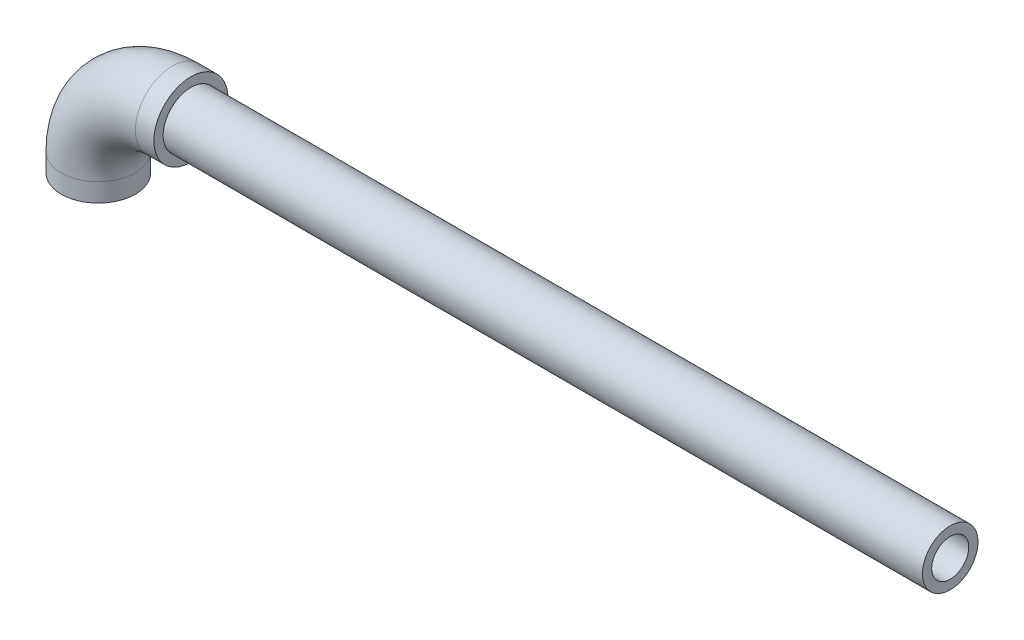
ISO-10303-21;
HEADER;
FILE_DESCRIPTION(('STEP AP214'),'2;1');
FILE_NAME('part.step','',(''),(''),'','','');
FILE_SCHEMA(('AUTOMOTIVE_DESIGN { 1 0 10303 214 1 1 1 1 }'));
ENDSEC;
DATA;
#1=APPLICATION_CONTEXT('core data for automotive mechanical design processes');
#2=APPLICATION_PROTOCOL_DEFINITION('international standard','automotive_design',2000,#1);
#3=PRODUCT_CONTEXT('',#1,'mechanical');
#4=PRODUCT('Part','Part','',(#3));
#5=PRODUCT_RELATED_PRODUCT_CATEGORY('part','',(#4));
#6=PRODUCT_DEFINITION_FORMATION('','',#4);
#7=PRODUCT_DEFINITION_CONTEXT('part definition',#1,'design');
#8=PRODUCT_DEFINITION('design','',#6,#7);
#9=PRODUCT_DEFINITION_SHAPE('','',#8);
#10=(LENGTH_UNIT() NAMED_UNIT(*) SI_UNIT(.MILLI.,.METRE.));
#11=(NAMED_UNIT(*) PLANE_ANGLE_UNIT() SI_UNIT($,.RADIAN.));
#12=(NAMED_UNIT(*) SI_UNIT($,.STERADIAN.) SOLID_ANGLE_UNIT());
#13=UNCERTAINTY_MEASURE_WITH_UNIT(LENGTH_MEASURE(1.E-05),#10,'distance_accuracy_value','');
#14=(GEOMETRIC_REPRESENTATION_CONTEXT(3) GLOBAL_UNCERTAINTY_ASSIGNED_CONTEXT((#13)) GLOBAL_UNIT_ASSIGNED_CONTEXT((#10,
#11,#12)) REPRESENTATION_CONTEXT('',''));
#15=CARTESIAN_POINT('',(0.,0.,0.));
#16=DIRECTION('',(0.,0.,1.));
#17=DIRECTION('',(1.,0.,0.));
#18=AXIS2_PLACEMENT_3D('',#15,#16,#17);
#19=CARTESIAN_POINT('',(460.,50.,0.));
#20=DIRECTION('',(1.,0.,0.));
#21=DIRECTION('',(0.,0.,-1.));
#22=AXIS2_PLACEMENT_3D('',#19,#20,#21);
#23=PLANE('',#22);
#24=CARTESIAN_POINT('',(460.,50.,0.));
#25=DIRECTION('',(1.,0.,0.));
#26=DIRECTION('',(0.,0.,-1.));
#27=AXIS2_PLACEMENT_3D('',#24,#25,#26);
#28=CIRCLE('',#27,15.);
#29=CARTESIAN_POINT('',(460.,50.,-15.));
#30=VERTEX_POINT('',#29);
#31=EDGE_CURVE('E11',#30,#30,#28,.T.);
#32=ORIENTED_EDGE('',*,*,#31,.T.);
#33=EDGE_LOOP('',(#32));
#34=FACE_BOUND('',#33,.T.);
#35=CARTESIAN_POINT('',(460.,50.,0.));
#36=DIRECTION('',(1.,0.,0.));
#37=DIRECTION('',(0.,0.,-1.));
#38=AXIS2_PLACEMENT_3D('',#35,#36,#37);
#39=CIRCLE('',#38,10.);
#40=CARTESIAN_POINT('',(460.,50.,-10.));
#41=VERTEX_POINT('',#40);
#42=EDGE_CURVE('E56',#41,#41,#39,.T.);
#43=ORIENTED_EDGE('',*,*,#42,.F.);
#44=EDGE_LOOP('',(#43));
#45=FACE_BOUND('',#44,.T.);
#46=ADVANCED_FACE('F45',(#34,#45),#23,.T.);
#47=CARTESIAN_POINT('',(50.,50.,0.));
#48=DIRECTION('',(1.,0.,0.));
#49=DIRECTION('',(0.,0.,-1.));
#50=AXIS2_PLACEMENT_3D('',#47,#48,#49);
#51=PLANE('',#50);
#52=CARTESIAN_POINT('',(50.,50.,0.));
#53=DIRECTION('',(1.,0.,0.));
#54=DIRECTION('',(0.,0.,-1.));
#55=AXIS2_PLACEMENT_3D('',#52,#53,#54);
#56=CIRCLE('',#55,15.);
#57=CARTESIAN_POINT('',(50.,50.,-15.));
#58=VERTEX_POINT('',#57);
#59=EDGE_CURVE('E49',#58,#58,#56,.T.);
#60=ORIENTED_EDGE('',*,*,#59,.F.);
#61=EDGE_LOOP('',(#60));
#62=FACE_BOUND('',#61,.T.);
#63=CARTESIAN_POINT('',(50.,50.,0.));
#64=DIRECTION('',(1.,0.,0.));
#65=DIRECTION('',(0.,0.,-1.));
#66=AXIS2_PLACEMENT_3D('',#63,#64,#65);
#67=CIRCLE('',#66,10.);
#68=CARTESIAN_POINT('',(50.,50.,-10.));
#69=VERTEX_POINT('',#68);
#70=EDGE_CURVE('E58',#69,#69,#67,.T.);
#71=ORIENTED_EDGE('',*,*,#70,.T.);
#72=EDGE_LOOP('',(#71));
#73=FACE_BOUND('',#72,.T.);
#74=ADVANCED_FACE('F68',(#62,#73),#51,.F.);
#75=CARTESIAN_POINT('',(460.,50.,0.));
#76=DIRECTION('',(-1.,0.,0.));
#77=DIRECTION('',(0.,0.,1.));
#78=AXIS2_PLACEMENT_3D('',#75,#76,#77);
#79=CYLINDRICAL_SURFACE('',#78,15.);
#80=ORIENTED_EDGE('',*,*,#31,.F.);
#81=EDGE_LOOP('',(#80));
#82=FACE_BOUND('',#81,.T.);
#83=ORIENTED_EDGE('',*,*,#59,.T.);
#84=EDGE_LOOP('',(#83));
#85=FACE_BOUND('',#84,.T.);
#86=ADVANCED_FACE('F47',(#82,#85),#79,.T.);
#87=CARTESIAN_POINT('',(460.,50.,0.));
#88=DIRECTION('',(-1.,0.,0.));
#89=DIRECTION('',(0.,0.,1.));
#90=AXIS2_PLACEMENT_3D('',#87,#88,#89);
#91=CYLINDRICAL_SURFACE('',#90,10.);
#92=ORIENTED_EDGE('',*,*,#42,.T.);
#93=EDGE_LOOP('',(#92));
#94=FACE_BOUND('',#93,.T.);
#95=ORIENTED_EDGE('',*,*,#70,.F.);
#96=EDGE_LOOP('',(#95));
#97=FACE_BOUND('',#96,.T.);
#98=ADVANCED_FACE('F64',(#94,#97),#91,.F.);
#99=CLOSED_SHELL('',(#46,#74,#86,#98));
#100=MANIFOLD_SOLID_BREP('B2',#99);
#101=CARTESIAN_POINT('',(0.,0.,0.));
#102=DIRECTION('',(0.,1.,0.));
#103=DIRECTION('',(0.,0.,1.));
#104=AXIS2_PLACEMENT_3D('',#101,#102,#103);
#105=CYLINDRICAL_SURFACE('',#104,20.);
#106=CARTESIAN_POINT('',(0.,10.,0.));
#107=DIRECTION('',(0.,1.,0.));
#108=DIRECTION('',(0.,0.,1.));
#109=AXIS2_PLACEMENT_3D('',#106,#107,#108);
#110=CIRCLE('',#109,20.);
#111=CARTESIAN_POINT('',(-20.,10.,0.));
#112=VERTEX_POINT('',#111);
#113=EDGE_CURVE('E130',#112,#112,#110,.T.);
#114=ORIENTED_EDGE('',*,*,#113,.F.);
#115=EDGE_LOOP('',(#114));
#116=FACE_BOUND('',#115,.T.);
#117=CARTESIAN_POINT('',(0.,0.,0.));
#118=DIRECTION('',(0.,1.,0.));
#119=DIRECTION('',(0.,0.,1.));
#120=AXIS2_PLACEMENT_3D('',#117,#118,#119);
#121=CIRCLE('',#120,20.);
#122=CARTESIAN_POINT('',(0.,0.,20.));
#123=VERTEX_POINT('',#122);
#124=EDGE_CURVE('E128',#123,#123,#121,.T.);
#125=ORIENTED_EDGE('',*,*,#124,.T.);
#126=EDGE_LOOP('',(#125));
#127=FACE_BOUND('',#126,.T.);
#128=ADVANCED_FACE('F107',(#116,#127),#105,.T.);
#129=CARTESIAN_POINT('',(40.,10.,0.));
#130=DIRECTION('',(0.,0.,-1.));
#131=DIRECTION('',(-1.,0.,0.));
#132=AXIS2_PLACEMENT_3D('',#129,#130,#131);
#133=TOROIDAL_SURFACE('',#132,40.,20.);
#134=CARTESIAN_POINT('',(40.,50.,0.));
#135=DIRECTION('',(1.,0.,0.));
#136=DIRECTION('',(0.,0.,1.));
#137=AXIS2_PLACEMENT_3D('',#134,#135,#136);
#138=CIRCLE('',#137,20.);
#139=CARTESIAN_POINT('',(40.,70.,0.));
#140=VERTEX_POINT('',#139);
#141=EDGE_CURVE('E111',#140,#140,#138,.T.);
#142=CARTESIAN_POINT('',(40.,10.,0.));
#143=DIRECTION('',(0.,0.,-1.));
#144=DIRECTION('',(-1.,0.,0.));
#145=AXIS2_PLACEMENT_3D('',#142,#143,#144);
#146=CIRCLE('',#145,60.);
#147=EDGE_CURVE('',#112,#140,#146,.T.);
#148=ORIENTED_EDGE('',*,*,#113,.T.);
#149=ORIENTED_EDGE('',*,*,#141,.F.);
#150=ORIENTED_EDGE('',*,*,#147,.T.);
#151=ORIENTED_EDGE('',*,*,#147,.F.);
#152=EDGE_LOOP('',(#148,#150,#149,#151));
#153=FACE_BOUND('',#152,.T.);
#154=ADVANCED_FACE('F138',(#153),#133,.T.);
#155=CARTESIAN_POINT('',(40.,50.,0.));
#156=DIRECTION('',(1.,0.,0.));
#157=DIRECTION('',(0.,0.,-1.));
#158=AXIS2_PLACEMENT_3D('',#155,#156,#157);
#159=CYLINDRICAL_SURFACE('',#158,20.);
#160=CARTESIAN_POINT('',(50.,50.,0.));
#161=DIRECTION('',(1.,0.,0.));
#162=DIRECTION('',(0.,0.,1.));
#163=AXIS2_PLACEMENT_3D('',#160,#161,#162);
#164=CIRCLE('',#163,20.);
#165=CARTESIAN_POINT('',(50.,50.,20.));
#166=VERTEX_POINT('',#165);
#167=EDGE_CURVE('E124',#166,#166,#164,.T.);
#168=ORIENTED_EDGE('',*,*,#167,.F.);
#169=EDGE_LOOP('',(#168));
#170=FACE_BOUND('',#169,.T.);
#171=ORIENTED_EDGE('',*,*,#141,.T.);
#172=EDGE_LOOP('',(#171));
#173=FACE_BOUND('',#172,.T.);
#174=ADVANCED_FACE('F109',(#170,#173),#159,.T.);
#175=CARTESIAN_POINT('',(0.,0.,0.));
#176=DIRECTION('',(0.,1.,0.));
#177=DIRECTION('',(0.,0.,1.));
#178=AXIS2_PLACEMENT_3D('',#175,#176,#177);
#179=PLANE('',#178);
#180=CARTESIAN_POINT('',(0.,0.,0.));
#181=DIRECTION('',(0.,1.,0.));
#182=DIRECTION('',(0.,0.,1.));
#183=AXIS2_PLACEMENT_3D('',#180,#181,#182);
#184=CIRCLE('',#183,15.);
#185=CARTESIAN_POINT('',(0.,0.,15.));
#186=VERTEX_POINT('',#185);
#187=EDGE_CURVE('E127',#186,#186,#184,.F.);
#188=ORIENTED_EDGE('',*,*,#187,.F.);
#189=EDGE_LOOP('',(#188));
#190=FACE_BOUND('',#189,.T.);
#191=ORIENTED_EDGE('',*,*,#124,.F.);
#192=EDGE_LOOP('',(#191));
#193=FACE_BOUND('',#192,.T.);
#194=ADVANCED_FACE('F144',(#190,#193),#179,.F.);
#195=CARTESIAN_POINT('',(50.,50.,0.));
#196=DIRECTION('',(1.,0.,0.));
#197=DIRECTION('',(0.,0.,1.));
#198=AXIS2_PLACEMENT_3D('',#195,#196,#197);
#199=PLANE('',#198);
#200=CARTESIAN_POINT('',(50.,50.,0.));
#201=DIRECTION('',(1.,0.,0.));
#202=DIRECTION('',(0.,0.,1.));
#203=AXIS2_PLACEMENT_3D('',#200,#201,#202);
#204=CIRCLE('',#203,15.);
#205=CARTESIAN_POINT('',(50.,50.,15.));
#206=VERTEX_POINT('',#205);
#207=EDGE_CURVE('E44',#206,#206,#204,.F.);
#208=ORIENTED_EDGE('',*,*,#207,.T.);
#209=EDGE_LOOP('',(#208));
#210=FACE_BOUND('',#209,.T.);
#211=ORIENTED_EDGE('',*,*,#167,.T.);
#212=EDGE_LOOP('',(#211));
#213=FACE_BOUND('',#212,.T.);
#214=ADVANCED_FACE('F162',(#210,#213),#199,.T.);
#215=CARTESIAN_POINT('',(0.,0.,0.));
#216=DIRECTION('',(0.,1.,0.));
#217=DIRECTION('',(0.,0.,1.));
#218=AXIS2_PLACEMENT_3D('',#215,#216,#217);
#219=CYLINDRICAL_SURFACE('',#218,15.);
#220=CARTESIAN_POINT('',(0.,10.,0.));
#221=DIRECTION('',(0.,1.,0.));
#222=DIRECTION('',(0.,0.,1.));
#223=AXIS2_PLACEMENT_3D('',#220,#221,#222);
#224=CIRCLE('',#223,15.);
#225=CARTESIAN_POINT('',(-15.,10.,0.));
#226=VERTEX_POINT('',#225);
#227=EDGE_CURVE('E120',#226,#226,#224,.F.);
#228=ORIENTED_EDGE('',*,*,#227,.F.);
#229=EDGE_LOOP('',(#228));
#230=FACE_BOUND('',#229,.T.);
#231=ORIENTED_EDGE('',*,*,#187,.T.);
#232=EDGE_LOOP('',(#231));
#233=FACE_BOUND('',#232,.T.);
#234=ADVANCED_FACE('F156',(#230,#233),#219,.F.);
#235=CARTESIAN_POINT('',(40.,10.,0.));
#236=DIRECTION('',(0.,0.,-1.));
#237=DIRECTION('',(-1.,0.,0.));
#238=AXIS2_PLACEMENT_3D('',#235,#236,#237);
#239=TOROIDAL_SURFACE('',#238,40.,15.);
#240=CARTESIAN_POINT('',(40.,50.,0.));
#241=DIRECTION('',(1.,0.,0.));
#242=DIRECTION('',(0.,0.,1.));
#243=AXIS2_PLACEMENT_3D('',#240,#241,#242);
#244=CIRCLE('',#243,15.);
#245=CARTESIAN_POINT('',(40.,65.,0.));
#246=VERTEX_POINT('',#245);
#247=EDGE_CURVE('E115',#246,#246,#244,.F.);
#248=CARTESIAN_POINT('',(40.,10.,0.));
#249=DIRECTION('',(0.,0.,-1.));
#250=DIRECTION('',(-1.,0.,0.));
#251=AXIS2_PLACEMENT_3D('',#248,#249,#250);
#252=CIRCLE('',#251,55.);
#253=EDGE_CURVE('',#226,#246,#252,.T.);
#254=ORIENTED_EDGE('',*,*,#227,.T.);
#255=ORIENTED_EDGE('',*,*,#247,.F.);
#256=ORIENTED_EDGE('',*,*,#253,.T.);
#257=ORIENTED_EDGE('',*,*,#253,.F.);
#258=EDGE_LOOP('',(#254,#256,#255,#257));
#259=FACE_BOUND('',#258,.T.);
#260=ADVANCED_FACE('F150',(#259),#239,.F.);
#261=CARTESIAN_POINT('',(40.,50.,0.));
#262=DIRECTION('',(1.,0.,0.));
#263=DIRECTION('',(0.,0.,-1.));
#264=AXIS2_PLACEMENT_3D('',#261,#262,#263);
#265=CYLINDRICAL_SURFACE('',#264,15.);
#266=ORIENTED_EDGE('',*,*,#207,.F.);
#267=EDGE_LOOP('',(#266));
#268=FACE_BOUND('',#267,.T.);
#269=ORIENTED_EDGE('',*,*,#247,.T.);
#270=EDGE_LOOP('',(#269));
#271=FACE_BOUND('',#270,.T.);
#272=ADVANCED_FACE('F148',(#268,#271),#265,.F.);
#273=CLOSED_SHELL('',(#128,#154,#174,#194,#214,#234,#260,#272));
#274=MANIFOLD_SOLID_BREP('B6',#273);
#275=ADVANCED_BREP_SHAPE_REPRESENTATION('',(#18,#100,#274),#14);
#276=SHAPE_DEFINITION_REPRESENTATION(#9,#275);
ENDSEC;
END-ISO-10303-21;
